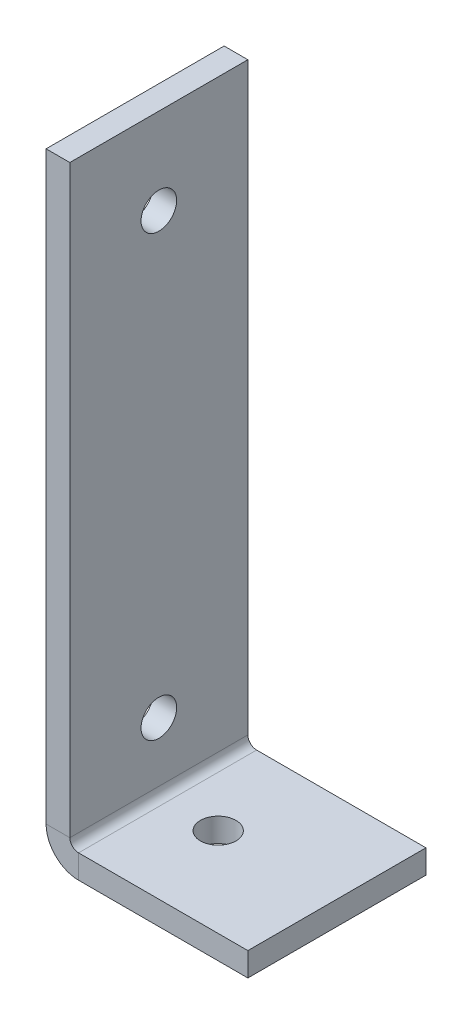
ISO-10303-21;
HEADER;
FILE_DESCRIPTION(('STEP AP214'),'2;1');
FILE_NAME('part.step','',(''),(''),'','','');
FILE_SCHEMA(('AUTOMOTIVE_DESIGN { 1 0 10303 214 1 1 1 1 }'));
ENDSEC;
DATA;
#1=APPLICATION_CONTEXT('core data for automotive mechanical design processes');
#2=APPLICATION_PROTOCOL_DEFINITION('international standard','automotive_design',2000,#1);
#3=PRODUCT_CONTEXT('',#1,'mechanical');
#4=PRODUCT('Part','Part','',(#3));
#5=PRODUCT_RELATED_PRODUCT_CATEGORY('part','',(#4));
#6=PRODUCT_DEFINITION_FORMATION('','',#4);
#7=PRODUCT_DEFINITION_CONTEXT('part definition',#1,'design');
#8=PRODUCT_DEFINITION('design','',#6,#7);
#9=PRODUCT_DEFINITION_SHAPE('','',#8);
#10=(LENGTH_UNIT() NAMED_UNIT(*) SI_UNIT(.MILLI.,.METRE.));
#11=(NAMED_UNIT(*) PLANE_ANGLE_UNIT() SI_UNIT($,.RADIAN.));
#12=(NAMED_UNIT(*) SI_UNIT($,.STERADIAN.) SOLID_ANGLE_UNIT());
#13=UNCERTAINTY_MEASURE_WITH_UNIT(LENGTH_MEASURE(1.E-05),#10,'distance_accuracy_value','');
#14=(GEOMETRIC_REPRESENTATION_CONTEXT(3) GLOBAL_UNCERTAINTY_ASSIGNED_CONTEXT((#13)) GLOBAL_UNIT_ASSIGNED_CONTEXT((#10,
#11,#12)) REPRESENTATION_CONTEXT('',''));
#15=CARTESIAN_POINT('',(0.,0.,0.));
#16=DIRECTION('',(0.,0.,1.));
#17=DIRECTION('',(1.,0.,0.));
#18=AXIS2_PLACEMENT_3D('',#15,#16,#17);
#19=CARTESIAN_POINT('',(0.7366,0.,15.));
#20=DIRECTION('',(0.,0.,1.));
#21=DIRECTION('',(1.,0.,0.));
#22=AXIS2_PLACEMENT_3D('',#19,#20,#21);
#23=PLANE('',#22);
#24=DIRECTION('',(0.,-1.,0.));
#25=VECTOR('',#24,1.);
#26=CARTESIAN_POINT('',(0.7366,0.,15.));
#27=LINE('',#26,#25);
#28=CARTESIAN_POINT('',(0.7366,0.,15.));
#29=VERTEX_POINT('',#28);
#30=CARTESIAN_POINT('',(0.7366,-2.,15.));
#31=VERTEX_POINT('',#30);
#32=EDGE_CURVE('E11',#29,#31,#27,.T.);
#33=ORIENTED_EDGE('',*,*,#32,.F.);
#34=CARTESIAN_POINT('',(0.7366,0.736599999999998,15.));
#35=DIRECTION('',(0.,0.,-1.));
#36=DIRECTION('',(-1.,0.,0.));
#37=AXIS2_PLACEMENT_3D('',#34,#35,#36);
#38=CIRCLE('',#37,0.7366);
#39=CARTESIAN_POINT('',(0.,0.736599999999997,15.));
#40=VERTEX_POINT('',#39);
#41=EDGE_CURVE('E133',#40,#29,#38,.F.);
#42=ORIENTED_EDGE('',*,*,#41,.F.);
#43=DIRECTION('',(1.,0.,0.));
#44=VECTOR('',#43,1.);
#45=CARTESIAN_POINT('',(-2.,0.736599999999994,15.));
#46=LINE('',#45,#44);
#47=CARTESIAN_POINT('',(-2.,0.736599999999994,15.));
#48=VERTEX_POINT('',#47);
#49=EDGE_CURVE('E44',#48,#40,#46,.T.);
#50=ORIENTED_EDGE('',*,*,#49,.F.);
#51=CARTESIAN_POINT('',(0.7366,0.736599999999998,15.));
#52=DIRECTION('',(0.,0.,1.));
#53=DIRECTION('',(1.,0.,0.));
#54=AXIS2_PLACEMENT_3D('',#51,#52,#53);
#55=CIRCLE('',#54,2.7366);
#56=EDGE_CURVE('E126',#48,#31,#55,.T.);
#57=ORIENTED_EDGE('',*,*,#56,.T.);
#58=EDGE_LOOP('',(#33,#42,#50,#57));
#59=FACE_BOUND('',#58,.T.);
#60=ADVANCED_FACE('F36',(#59),#23,.T.);
#61=CARTESIAN_POINT('',(-2.,0.736599999999994,15.));
#62=DIRECTION('',(0.,0.,1.));
#63=DIRECTION('',(1.,0.,0.));
#64=AXIS2_PLACEMENT_3D('',#61,#62,#63);
#65=PLANE('',#64);
#66=DIRECTION('',(1.,0.,0.));
#67=VECTOR('',#66,1.);
#68=CARTESIAN_POINT('',(0.,0.,15.));
#69=LINE('',#68,#67);
#70=CARTESIAN_POINT('',(15.,0.,15.));
#71=VERTEX_POINT('',#70);
#72=EDGE_CURVE('E183',#29,#71,#69,.T.);
#73=ORIENTED_EDGE('',*,*,#72,.F.);
#74=ORIENTED_EDGE('',*,*,#32,.T.);
#75=DIRECTION('',(1.,0.,0.));
#76=VECTOR('',#75,1.);
#77=CARTESIAN_POINT('',(0.,-2.,15.));
#78=LINE('',#77,#76);
#79=CARTESIAN_POINT('',(15.,-2.,15.));
#80=VERTEX_POINT('',#79);
#81=EDGE_CURVE('E92',#31,#80,#78,.T.);
#82=ORIENTED_EDGE('',*,*,#81,.T.);
#83=DIRECTION('',(0.,-1.,0.));
#84=VECTOR('',#83,1.);
#85=CARTESIAN_POINT('',(15.,0.,15.));
#86=LINE('',#85,#84);
#87=EDGE_CURVE('E397',#71,#80,#86,.T.);
#88=ORIENTED_EDGE('',*,*,#87,.F.);
#89=EDGE_LOOP('',(#73,#74,#82,#88));
#90=FACE_BOUND('',#89,.T.);
#91=ADVANCED_FACE('F191',(#90),#65,.T.);
#92=CARTESIAN_POINT('',(0.,0.736599999999997,0.));
#93=DIRECTION('',(0.,0.,-1.));
#94=DIRECTION('',(-1.,0.,0.));
#95=AXIS2_PLACEMENT_3D('',#92,#93,#94);
#96=PLANE('',#95);
#97=DIRECTION('',(-1.,0.,0.));
#98=VECTOR('',#97,1.);
#99=CARTESIAN_POINT('',(0.,0.736599999999997,0.));
#100=LINE('',#99,#98);
#101=CARTESIAN_POINT('',(0.,0.736599999999997,0.));
#102=VERTEX_POINT('',#101);
#103=CARTESIAN_POINT('',(-2.,0.736599999999994,0.));
#104=VERTEX_POINT('',#103);
#105=EDGE_CURVE('E79',#102,#104,#100,.T.);
#106=ORIENTED_EDGE('',*,*,#105,.F.);
#107=CARTESIAN_POINT('',(0.7366,0.736599999999998,0.));
#108=DIRECTION('',(0.,0.,-1.));
#109=DIRECTION('',(-1.,0.,0.));
#110=AXIS2_PLACEMENT_3D('',#107,#108,#109);
#111=CIRCLE('',#110,0.7366);
#112=CARTESIAN_POINT('',(0.7366,0.,0.));
#113=VERTEX_POINT('',#112);
#114=EDGE_CURVE('E149',#102,#113,#111,.F.);
#115=ORIENTED_EDGE('',*,*,#114,.T.);
#116=DIRECTION('',(0.,1.,0.));
#117=VECTOR('',#116,1.);
#118=CARTESIAN_POINT('',(0.7366,-2.,0.));
#119=LINE('',#118,#117);
#120=CARTESIAN_POINT('',(0.7366,-2.,0.));
#121=VERTEX_POINT('',#120);
#122=EDGE_CURVE('E86',#121,#113,#119,.T.);
#123=ORIENTED_EDGE('',*,*,#122,.F.);
#124=CARTESIAN_POINT('',(0.7366,0.736599999999998,0.));
#125=DIRECTION('',(0.,0.,1.));
#126=DIRECTION('',(1.,0.,0.));
#127=AXIS2_PLACEMENT_3D('',#124,#125,#126);
#128=CIRCLE('',#127,2.7366);
#129=EDGE_CURVE('E156',#104,#121,#128,.T.);
#130=ORIENTED_EDGE('',*,*,#129,.F.);
#131=EDGE_LOOP('',(#106,#115,#123,#130));
#132=FACE_BOUND('',#131,.T.);
#133=ADVANCED_FACE('F189',(#132),#96,.T.);
#134=CARTESIAN_POINT('',(0.7366,-2.,0.));
#135=DIRECTION('',(0.,0.,-1.));
#136=DIRECTION('',(-1.,0.,0.));
#137=AXIS2_PLACEMENT_3D('',#134,#135,#136);
#138=PLANE('',#137);
#139=DIRECTION('',(0.,-1.,0.));
#140=VECTOR('',#139,1.);
#141=CARTESIAN_POINT('',(0.,50.,0.));
#142=LINE('',#141,#140);
#143=CARTESIAN_POINT('',(0.,50.,0.));
#144=VERTEX_POINT('',#143);
#145=EDGE_CURVE('E151',#144,#102,#142,.T.);
#146=ORIENTED_EDGE('',*,*,#145,.T.);
#147=ORIENTED_EDGE('',*,*,#105,.T.);
#148=DIRECTION('',(0.,-1.,0.));
#149=VECTOR('',#148,1.);
#150=CARTESIAN_POINT('',(-2.,50.,0.));
#151=LINE('',#150,#149);
#152=CARTESIAN_POINT('',(-2.,50.,0.));
#153=VERTEX_POINT('',#152);
#154=EDGE_CURVE('E154',#153,#104,#151,.T.);
#155=ORIENTED_EDGE('',*,*,#154,.F.);
#156=DIRECTION('',(1.,0.,0.));
#157=VECTOR('',#156,1.);
#158=CARTESIAN_POINT('',(-2.,50.,0.));
#159=LINE('',#158,#157);
#160=EDGE_CURVE('E114',#153,#144,#159,.T.);
#161=ORIENTED_EDGE('',*,*,#160,.T.);
#162=EDGE_LOOP('',(#146,#147,#155,#161));
#163=FACE_BOUND('',#162,.T.);
#164=ADVANCED_FACE('F185',(#163),#138,.T.);
#165=CARTESIAN_POINT('',(0.,-2.,15.));
#166=DIRECTION('',(0.,1.,0.));
#167=DIRECTION('',(0.,0.,1.));
#168=AXIS2_PLACEMENT_3D('',#165,#166,#167);
#169=PLANE('',#168);
#170=CARTESIAN_POINT('',(5.,-2.,7.5));
#171=DIRECTION('',(0.,1.,0.));
#172=DIRECTION('',(0.,0.,1.));
#173=AXIS2_PLACEMENT_3D('',#170,#171,#172);
#174=CIRCLE('',#173,1.5);
#175=CARTESIAN_POINT('',(5.,-2.,9.));
#176=VERTEX_POINT('',#175);
#177=EDGE_CURVE('E143',#176,#176,#174,.T.);
#178=ORIENTED_EDGE('',*,*,#177,.T.);
#179=EDGE_LOOP('',(#178));
#180=FACE_BOUND('',#179,.T.);
#181=DIRECTION('',(1.,0.,0.));
#182=VECTOR('',#181,1.);
#183=CARTESIAN_POINT('',(0.,-2.,0.));
#184=LINE('',#183,#182);
#185=CARTESIAN_POINT('',(15.,-2.,0.));
#186=VERTEX_POINT('',#185);
#187=EDGE_CURVE('E139',#121,#186,#184,.T.);
#188=ORIENTED_EDGE('',*,*,#187,.T.);
#189=DIRECTION('',(0.,0.,-1.));
#190=VECTOR('',#189,1.);
#191=CARTESIAN_POINT('',(15.,-2.,15.));
#192=LINE('',#191,#190);
#193=EDGE_CURVE('E170',#80,#186,#192,.T.);
#194=ORIENTED_EDGE('',*,*,#193,.F.);
#195=ORIENTED_EDGE('',*,*,#81,.F.);
#196=DIRECTION('',(0.,0.,-1.));
#197=VECTOR('',#196,1.);
#198=CARTESIAN_POINT('',(0.7366,-2.,15.));
#199=LINE('',#198,#197);
#200=EDGE_CURVE('E138',#31,#121,#199,.T.);
#201=ORIENTED_EDGE('',*,*,#200,.T.);
#202=EDGE_LOOP('',(#188,#194,#195,#201));
#203=FACE_BOUND('',#202,.T.);
#204=ADVANCED_FACE('F197',(#180,#203),#169,.F.);
#205=CARTESIAN_POINT('',(15.,0.,15.));
#206=DIRECTION('',(1.,0.,0.));
#207=DIRECTION('',(0.,0.,-1.));
#208=AXIS2_PLACEMENT_3D('',#205,#206,#207);
#209=PLANE('',#208);
#210=DIRECTION('',(0.,-1.,0.));
#211=VECTOR('',#210,1.);
#212=CARTESIAN_POINT('',(15.,0.,0.));
#213=LINE('',#212,#211);
#214=CARTESIAN_POINT('',(15.,0.,0.));
#215=VERTEX_POINT('',#214);
#216=EDGE_CURVE('E142',#215,#186,#213,.T.);
#217=ORIENTED_EDGE('',*,*,#216,.F.);
#218=DIRECTION('',(0.,0.,-1.));
#219=VECTOR('',#218,1.);
#220=CARTESIAN_POINT('',(15.,0.,15.));
#221=LINE('',#220,#219);
#222=EDGE_CURVE('E168',#71,#215,#221,.T.);
#223=ORIENTED_EDGE('',*,*,#222,.F.);
#224=ORIENTED_EDGE('',*,*,#87,.T.);
#225=ORIENTED_EDGE('',*,*,#193,.T.);
#226=EDGE_LOOP('',(#217,#223,#224,#225));
#227=FACE_BOUND('',#226,.T.);
#228=ADVANCED_FACE('F226',(#227),#209,.T.);
#229=CARTESIAN_POINT('',(0.,0.,15.));
#230=DIRECTION('',(0.,1.,0.));
#231=DIRECTION('',(0.,0.,1.));
#232=AXIS2_PLACEMENT_3D('',#229,#230,#231);
#233=PLANE('',#232);
#234=CARTESIAN_POINT('',(5.,0.,7.5));
#235=DIRECTION('',(0.,1.,0.));
#236=DIRECTION('',(0.,0.,1.));
#237=AXIS2_PLACEMENT_3D('',#234,#235,#236);
#238=CIRCLE('',#237,1.5);
#239=CARTESIAN_POINT('',(5.,0.,9.));
#240=VERTEX_POINT('',#239);
#241=EDGE_CURVE('E384',#240,#240,#238,.T.);
#242=ORIENTED_EDGE('',*,*,#241,.F.);
#243=EDGE_LOOP('',(#242));
#244=FACE_BOUND('',#243,.T.);
#245=DIRECTION('',(1.,0.,0.));
#246=VECTOR('',#245,1.);
#247=CARTESIAN_POINT('',(0.,0.,0.));
#248=LINE('',#247,#246);
#249=EDGE_CURVE('E146',#113,#215,#248,.T.);
#250=ORIENTED_EDGE('',*,*,#249,.F.);
#251=DIRECTION('',(0.,0.,-1.));
#252=VECTOR('',#251,1.);
#253=CARTESIAN_POINT('',(0.7366,0.,15.));
#254=LINE('',#253,#252);
#255=EDGE_CURVE('E165',#29,#113,#254,.T.);
#256=ORIENTED_EDGE('',*,*,#255,.F.);
#257=ORIENTED_EDGE('',*,*,#72,.T.);
#258=ORIENTED_EDGE('',*,*,#222,.T.);
#259=EDGE_LOOP('',(#250,#256,#257,#258));
#260=FACE_BOUND('',#259,.T.);
#261=ADVANCED_FACE('F231',(#244,#260),#233,.T.);
#262=CARTESIAN_POINT('',(0.7366,0.736599999999998,15.));
#263=DIRECTION('',(0.,0.,-1.));
#264=DIRECTION('',(-1.,0.,0.));
#265=AXIS2_PLACEMENT_3D('',#262,#263,#264);
#266=CYLINDRICAL_SURFACE('',#265,0.7366);
#267=ORIENTED_EDGE('',*,*,#114,.F.);
#268=DIRECTION('',(0.,0.,-1.));
#269=VECTOR('',#268,1.);
#270=CARTESIAN_POINT('',(0.,0.736599999999997,15.));
#271=LINE('',#270,#269);
#272=EDGE_CURVE('E162',#40,#102,#271,.T.);
#273=ORIENTED_EDGE('',*,*,#272,.F.);
#274=ORIENTED_EDGE('',*,*,#41,.T.);
#275=ORIENTED_EDGE('',*,*,#255,.T.);
#276=EDGE_LOOP('',(#267,#273,#274,#275));
#277=FACE_BOUND('',#276,.T.);
#278=ADVANCED_FACE('F179',(#277),#266,.F.);
#279=CARTESIAN_POINT('',(0.,50.,15.));
#280=DIRECTION('',(1.,0.,0.));
#281=DIRECTION('',(0.,1.,0.));
#282=AXIS2_PLACEMENT_3D('',#279,#280,#281);
#283=PLANE('',#282);
#284=CARTESIAN_POINT('',(0.,42.7366,7.5));
#285=DIRECTION('',(1.,0.,0.));
#286=DIRECTION('',(0.,1.,0.));
#287=AXIS2_PLACEMENT_3D('',#284,#285,#286);
#288=CIRCLE('',#287,1.5);
#289=CARTESIAN_POINT('',(0.,44.2366,7.5));
#290=VERTEX_POINT('',#289);
#291=EDGE_CURVE('E381',#290,#290,#288,.T.);
#292=ORIENTED_EDGE('',*,*,#291,.F.);
#293=EDGE_LOOP('',(#292));
#294=FACE_BOUND('',#293,.T.);
#295=CARTESIAN_POINT('',(0.,5.7366,7.49999999999999));
#296=DIRECTION('',(1.,0.,0.));
#297=DIRECTION('',(0.,1.,0.));
#298=AXIS2_PLACEMENT_3D('',#295,#296,#297);
#299=CIRCLE('',#298,1.5);
#300=CARTESIAN_POINT('',(0.,7.2366,7.49999999999999));
#301=VERTEX_POINT('',#300);
#302=EDGE_CURVE('E387',#301,#301,#299,.T.);
#303=ORIENTED_EDGE('',*,*,#302,.F.);
#304=EDGE_LOOP('',(#303));
#305=FACE_BOUND('',#304,.T.);
#306=ORIENTED_EDGE('',*,*,#145,.F.);
#307=DIRECTION('',(0.,0.,-1.));
#308=VECTOR('',#307,1.);
#309=CARTESIAN_POINT('',(0.,50.,15.));
#310=LINE('',#309,#308);
#311=CARTESIAN_POINT('',(0.,50.,15.));
#312=VERTEX_POINT('',#311);
#313=EDGE_CURVE('E116',#312,#144,#310,.T.);
#314=ORIENTED_EDGE('',*,*,#313,.F.);
#315=DIRECTION('',(0.,-1.,0.));
#316=VECTOR('',#315,1.);
#317=CARTESIAN_POINT('',(0.,50.,15.));
#318=LINE('',#317,#316);
#319=EDGE_CURVE('E131',#312,#40,#318,.T.);
#320=ORIENTED_EDGE('',*,*,#319,.T.);
#321=ORIENTED_EDGE('',*,*,#272,.T.);
#322=EDGE_LOOP('',(#306,#314,#320,#321));
#323=FACE_BOUND('',#322,.T.);
#324=ADVANCED_FACE('F184',(#294,#305,#323),#283,.T.);
#325=CARTESIAN_POINT('',(-2.,50.,15.));
#326=DIRECTION('',(0.,1.,0.));
#327=DIRECTION('',(0.,0.,1.));
#328=AXIS2_PLACEMENT_3D('',#325,#326,#327);
#329=PLANE('',#328);
#330=ORIENTED_EDGE('',*,*,#160,.F.);
#331=DIRECTION('',(0.,0.,-1.));
#332=VECTOR('',#331,1.);
#333=CARTESIAN_POINT('',(-2.,50.,15.));
#334=LINE('',#333,#332);
#335=CARTESIAN_POINT('',(-2.,50.,15.));
#336=VERTEX_POINT('',#335);
#337=EDGE_CURVE('E108',#336,#153,#334,.T.);
#338=ORIENTED_EDGE('',*,*,#337,.F.);
#339=DIRECTION('',(1.,0.,0.));
#340=VECTOR('',#339,1.);
#341=CARTESIAN_POINT('',(-2.,50.,15.));
#342=LINE('',#341,#340);
#343=EDGE_CURVE('E112',#336,#312,#342,.T.);
#344=ORIENTED_EDGE('',*,*,#343,.T.);
#345=ORIENTED_EDGE('',*,*,#313,.T.);
#346=EDGE_LOOP('',(#330,#338,#344,#345));
#347=FACE_BOUND('',#346,.T.);
#348=ADVANCED_FACE('F110',(#347),#329,.T.);
#349=CARTESIAN_POINT('',(-2.,50.,15.));
#350=DIRECTION('',(1.,0.,0.));
#351=DIRECTION('',(0.,1.,0.));
#352=AXIS2_PLACEMENT_3D('',#349,#350,#351);
#353=PLANE('',#352);
#354=CARTESIAN_POINT('',(-2.00000000000001,42.7366,7.5));
#355=DIRECTION('',(1.,0.,0.));
#356=DIRECTION('',(0.,1.,0.));
#357=AXIS2_PLACEMENT_3D('',#354,#355,#356);
#358=CIRCLE('',#357,1.5);
#359=CARTESIAN_POINT('',(-2.00000000000001,44.2366,7.5));
#360=VERTEX_POINT('',#359);
#361=EDGE_CURVE('E378',#360,#360,#358,.T.);
#362=ORIENTED_EDGE('',*,*,#361,.T.);
#363=EDGE_LOOP('',(#362));
#364=FACE_BOUND('',#363,.T.);
#365=CARTESIAN_POINT('',(-2.,5.7366,7.49999999999999));
#366=DIRECTION('',(1.,0.,0.));
#367=DIRECTION('',(0.,1.,0.));
#368=AXIS2_PLACEMENT_3D('',#365,#366,#367);
#369=CIRCLE('',#368,1.5);
#370=CARTESIAN_POINT('',(-2.,7.2366,7.49999999999999));
#371=VERTEX_POINT('',#370);
#372=EDGE_CURVE('E382',#371,#371,#369,.T.);
#373=ORIENTED_EDGE('',*,*,#372,.T.);
#374=EDGE_LOOP('',(#373));
#375=FACE_BOUND('',#374,.T.);
#376=ORIENTED_EDGE('',*,*,#154,.T.);
#377=DIRECTION('',(0.,0.,-1.));
#378=VECTOR('',#377,1.);
#379=CARTESIAN_POINT('',(-2.,0.736599999999994,15.));
#380=LINE('',#379,#378);
#381=EDGE_CURVE('E117',#48,#104,#380,.T.);
#382=ORIENTED_EDGE('',*,*,#381,.F.);
#383=DIRECTION('',(0.,-1.,0.));
#384=VECTOR('',#383,1.);
#385=CARTESIAN_POINT('',(-2.,50.,15.));
#386=LINE('',#385,#384);
#387=EDGE_CURVE('E121',#336,#48,#386,.T.);
#388=ORIENTED_EDGE('',*,*,#387,.F.);
#389=ORIENTED_EDGE('',*,*,#337,.T.);
#390=EDGE_LOOP('',(#376,#382,#388,#389));
#391=FACE_BOUND('',#390,.T.);
#392=ADVANCED_FACE('F122',(#364,#375,#391),#353,.F.);
#393=CARTESIAN_POINT('',(0.7366,0.736599999999998,15.));
#394=DIRECTION('',(0.,0.,-1.));
#395=DIRECTION('',(-1.,0.,0.));
#396=AXIS2_PLACEMENT_3D('',#393,#394,#395);
#397=CYLINDRICAL_SURFACE('',#396,2.7366);
#398=ORIENTED_EDGE('',*,*,#129,.T.);
#399=ORIENTED_EDGE('',*,*,#200,.F.);
#400=ORIENTED_EDGE('',*,*,#56,.F.);
#401=ORIENTED_EDGE('',*,*,#381,.T.);
#402=EDGE_LOOP('',(#398,#399,#400,#401));
#403=FACE_BOUND('',#402,.T.);
#404=ADVANCED_FACE('F187',(#403),#397,.T.);
#405=CARTESIAN_POINT('',(0.7366,0.736599999999998,15.));
#406=DIRECTION('',(0.,0.,-1.));
#407=DIRECTION('',(-1.,0.,0.));
#408=AXIS2_PLACEMENT_3D('',#405,#406,#407);
#409=PLANE('',#408);
#410=ORIENTED_EDGE('',*,*,#387,.T.);
#411=ORIENTED_EDGE('',*,*,#49,.T.);
#412=ORIENTED_EDGE('',*,*,#319,.F.);
#413=ORIENTED_EDGE('',*,*,#343,.F.);
#414=EDGE_LOOP('',(#410,#411,#412,#413));
#415=FACE_BOUND('',#414,.T.);
#416=ADVANCED_FACE('F129',(#415),#409,.F.);
#417=CARTESIAN_POINT('',(0.7366,0.736599999999998,0.));
#418=DIRECTION('',(0.,0.,-1.));
#419=DIRECTION('',(-1.,0.,0.));
#420=AXIS2_PLACEMENT_3D('',#417,#418,#419);
#421=PLANE('',#420);
#422=ORIENTED_EDGE('',*,*,#187,.F.);
#423=ORIENTED_EDGE('',*,*,#122,.T.);
#424=ORIENTED_EDGE('',*,*,#249,.T.);
#425=ORIENTED_EDGE('',*,*,#216,.T.);
#426=EDGE_LOOP('',(#422,#423,#424,#425));
#427=FACE_BOUND('',#426,.T.);
#428=ADVANCED_FACE('F275',(#427),#421,.T.);
#429=CARTESIAN_POINT('',(5.,-2.,7.5));
#430=DIRECTION('',(0.,1.,0.));
#431=DIRECTION('',(0.,0.,1.));
#432=AXIS2_PLACEMENT_3D('',#429,#430,#431);
#433=CYLINDRICAL_SURFACE('',#432,1.5);
#434=ORIENTED_EDGE('',*,*,#177,.F.);
#435=EDGE_LOOP('',(#434));
#436=FACE_BOUND('',#435,.T.);
#437=ORIENTED_EDGE('',*,*,#241,.T.);
#438=EDGE_LOOP('',(#437));
#439=FACE_BOUND('',#438,.T.);
#440=ADVANCED_FACE('F285',(#436,#439),#433,.F.);
#441=CARTESIAN_POINT('',(-2.,5.7366,7.49999999999999));
#442=DIRECTION('',(1.,0.,0.));
#443=DIRECTION('',(0.,1.,0.));
#444=AXIS2_PLACEMENT_3D('',#441,#442,#443);
#445=CYLINDRICAL_SURFACE('',#444,1.5);
#446=ORIENTED_EDGE('',*,*,#372,.F.);
#447=EDGE_LOOP('',(#446));
#448=FACE_BOUND('',#447,.T.);
#449=ORIENTED_EDGE('',*,*,#302,.T.);
#450=EDGE_LOOP('',(#449));
#451=FACE_BOUND('',#450,.T.);
#452=ADVANCED_FACE('F312',(#448,#451),#445,.F.);
#453=CARTESIAN_POINT('',(-2.00000000000001,42.7366,7.5));
#454=DIRECTION('',(1.,0.,0.));
#455=DIRECTION('',(0.,1.,0.));
#456=AXIS2_PLACEMENT_3D('',#453,#454,#455);
#457=CYLINDRICAL_SURFACE('',#456,1.5);
#458=ORIENTED_EDGE('',*,*,#361,.F.);
#459=EDGE_LOOP('',(#458));
#460=FACE_BOUND('',#459,.T.);
#461=ORIENTED_EDGE('',*,*,#291,.T.);
#462=EDGE_LOOP('',(#461));
#463=FACE_BOUND('',#462,.T.);
#464=ADVANCED_FACE('F339',(#460,#463),#457,.F.);
#465=CLOSED_SHELL('',(#60,#91,#133,#164,#204,#228,#261,#278,#324,#348,#392,#404,#416,#428,#440,
#452,#464));
#466=MANIFOLD_SOLID_BREP('B2',#465);
#467=ADVANCED_BREP_SHAPE_REPRESENTATION('',(#18,#466),#14);
#468=SHAPE_DEFINITION_REPRESENTATION(#9,#467);
ENDSEC;
END-ISO-10303-21;
